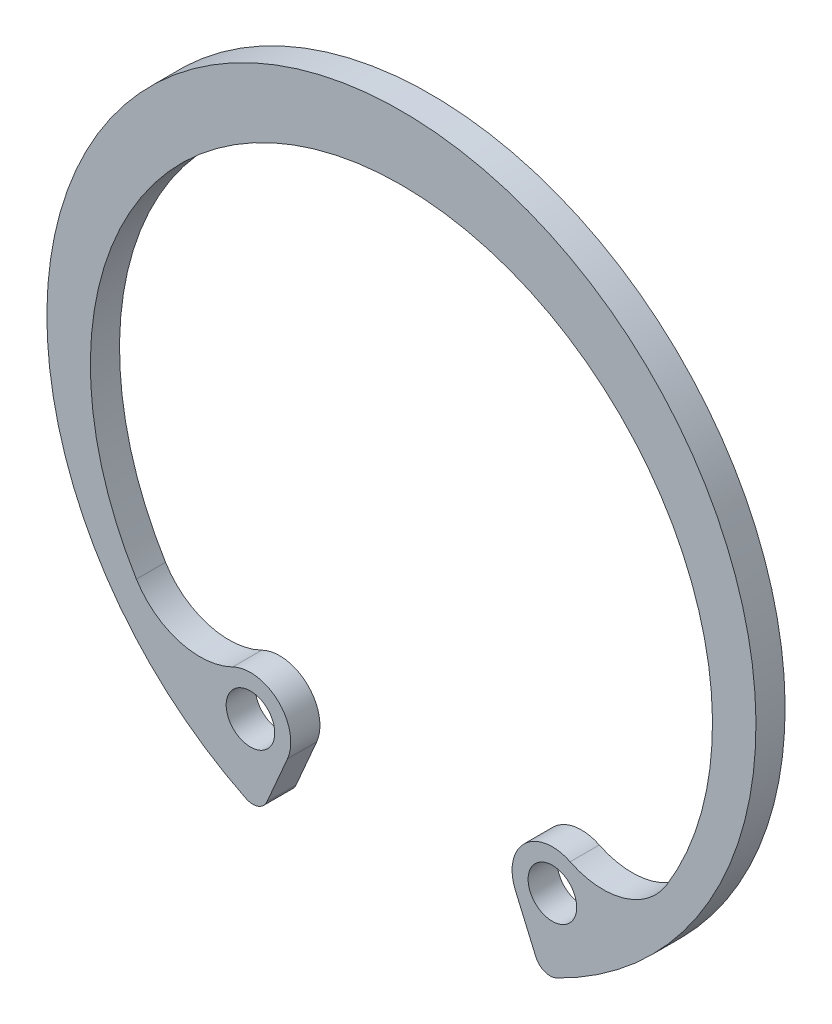
ISO-10303-21;
HEADER;
FILE_DESCRIPTION(('STEP AP214'),'2;1');
FILE_NAME('part.step','',(''),(''),'','','');
FILE_SCHEMA(('AUTOMOTIVE_DESIGN { 1 0 10303 214 1 1 1 1 }'));
ENDSEC;
DATA;
#1=APPLICATION_CONTEXT('core data for automotive mechanical design processes');
#2=APPLICATION_PROTOCOL_DEFINITION('international standard','automotive_design',2000,#1);
#3=PRODUCT_CONTEXT('',#1,'mechanical');
#4=PRODUCT('Part','Part','',(#3));
#5=PRODUCT_RELATED_PRODUCT_CATEGORY('part','',(#4));
#6=PRODUCT_DEFINITION_FORMATION('','',#4);
#7=PRODUCT_DEFINITION_CONTEXT('part definition',#1,'design');
#8=PRODUCT_DEFINITION('design','',#6,#7);
#9=PRODUCT_DEFINITION_SHAPE('','',#8);
#10=(LENGTH_UNIT() NAMED_UNIT(*) SI_UNIT(.MILLI.,.METRE.));
#11=(NAMED_UNIT(*) PLANE_ANGLE_UNIT() SI_UNIT($,.RADIAN.));
#12=(NAMED_UNIT(*) SI_UNIT($,.STERADIAN.) SOLID_ANGLE_UNIT());
#13=UNCERTAINTY_MEASURE_WITH_UNIT(LENGTH_MEASURE(1.E-05),#10,'distance_accuracy_value','');
#14=(GEOMETRIC_REPRESENTATION_CONTEXT(3) GLOBAL_UNCERTAINTY_ASSIGNED_CONTEXT((#13)) GLOBAL_UNIT_ASSIGNED_CONTEXT((#10,
#11,#12)) REPRESENTATION_CONTEXT('',''));
#15=CARTESIAN_POINT('',(0.,0.,0.));
#16=DIRECTION('',(0.,0.,1.));
#17=DIRECTION('',(1.,0.,0.));
#18=AXIS2_PLACEMENT_3D('',#15,#16,#17);
#19=CARTESIAN_POINT('',(0.,0.,-0.750000000000001));
#20=DIRECTION('',(0.,0.,1.));
#21=DIRECTION('',(1.,0.,0.));
#22=AXIS2_PLACEMENT_3D('',#19,#20,#21);
#23=CYLINDRICAL_SURFACE('',#22,18.25);
#24=CARTESIAN_POINT('',(0.,0.,0.749999999999999));
#25=DIRECTION('',(0.,0.,1.));
#26=DIRECTION('',(-1.,0.,0.));
#27=AXIS2_PLACEMENT_3D('',#24,#25,#26);
#28=CIRCLE('',#27,18.25);
#29=CARTESIAN_POINT('',(7.99738414547643,-16.4044002276731,0.749999999999999));
#30=VERTEX_POINT('',#29);
#31=CARTESIAN_POINT('',(-7.99738414547643,-16.4044002276731,0.749999999999999));
#32=VERTEX_POINT('',#31);
#33=EDGE_CURVE('E130',#30,#32,#28,.T.);
#34=ORIENTED_EDGE('',*,*,#33,.F.);
#35=DIRECTION('',(0.,0.,1.));
#36=VECTOR('',#35,1.);
#37=CARTESIAN_POINT('',(7.99738414547643,-16.4044002276731,-0.750000000000001));
#38=LINE('',#37,#36);
#39=CARTESIAN_POINT('',(7.99738414547643,-16.4044002276731,-0.750000000000001));
#40=VERTEX_POINT('',#39);
#41=EDGE_CURVE('E228',#30,#40,#38,.F.);
#42=ORIENTED_EDGE('',*,*,#41,.T.);
#43=CARTESIAN_POINT('',(0.,0.,-0.750000000000001));
#44=DIRECTION('',(0.,0.,1.));
#45=DIRECTION('',(-1.,0.,0.));
#46=AXIS2_PLACEMENT_3D('',#43,#44,#45);
#47=CIRCLE('',#46,18.25);
#48=CARTESIAN_POINT('',(-7.99738414547643,-16.4044002276731,-0.750000000000001));
#49=VERTEX_POINT('',#48);
#50=EDGE_CURVE('E174',#40,#49,#47,.T.);
#51=ORIENTED_EDGE('',*,*,#50,.T.);
#52=DIRECTION('',(0.,0.,1.));
#53=VECTOR('',#52,1.);
#54=CARTESIAN_POINT('',(-7.99738414547643,-16.4044002276731,-0.750000000000001));
#55=LINE('',#54,#53);
#56=EDGE_CURVE('E224',#49,#32,#55,.T.);
#57=ORIENTED_EDGE('',*,*,#56,.T.);
#58=EDGE_LOOP('',(#34,#42,#51,#57));
#59=FACE_BOUND('',#58,.T.);
#60=ADVANCED_FACE('F41',(#59),#23,.T.);
#61=CARTESIAN_POINT('',(5.86601370024973,-13.5661300033754,-0.750000000000001));
#62=DIRECTION('',(-0.917867410140358,-0.396887159533074,0.));
#63=DIRECTION('',(0.396887159533074,-0.917867410140358,0.));
#64=AXIS2_PLACEMENT_3D('',#61,#62,#63);
#65=PLANE('',#64);
#66=DIRECTION('',(0.396887159533074,-0.917867410140358,0.));
#67=VECTOR('',#66,1.);
#68=CARTESIAN_POINT('',(5.86601370024973,-13.5661300033754,-0.750000000000001));
#69=LINE('',#68,#67);
#70=CARTESIAN_POINT('',(5.86601370024973,-13.5661300033754,-0.750000000000001));
#71=VERTEX_POINT('',#70);
#72=CARTESIAN_POINT('',(6.92099545495303,-16.0059503595544,-0.750000000000001));
#73=VERTEX_POINT('',#72);
#74=EDGE_CURVE('E141',#71,#73,#69,.T.);
#75=ORIENTED_EDGE('',*,*,#74,.T.);
#76=DIRECTION('',(0.,0.,1.));
#77=VECTOR('',#76,1.);
#78=CARTESIAN_POINT('',(6.92099545495303,-16.0059503595544,-0.750000000000001));
#79=LINE('',#78,#77);
#80=CARTESIAN_POINT('',(6.92099545495303,-16.0059503595544,0.749999999999999));
#81=VERTEX_POINT('',#80);
#82=EDGE_CURVE('E204',#73,#81,#79,.T.);
#83=ORIENTED_EDGE('',*,*,#82,.T.);
#84=DIRECTION('',(0.396887159533074,-0.917867410140358,0.));
#85=VECTOR('',#84,1.);
#86=CARTESIAN_POINT('',(5.86601370024973,-13.5661300033754,0.749999999999999));
#87=LINE('',#86,#85);
#88=CARTESIAN_POINT('',(5.86601370024973,-13.5661300033754,0.749999999999999));
#89=VERTEX_POINT('',#88);
#90=EDGE_CURVE('E163',#89,#81,#87,.T.);
#91=ORIENTED_EDGE('',*,*,#90,.F.);
#92=DIRECTION('',(0.,0.,1.));
#93=VECTOR('',#92,1.);
#94=CARTESIAN_POINT('',(5.86601370024973,-13.5661300033754,-0.750000000000001));
#95=LINE('',#94,#93);
#96=EDGE_CURVE('E201',#71,#89,#95,.T.);
#97=ORIENTED_EDGE('',*,*,#96,.F.);
#98=EDGE_LOOP('',(#75,#83,#91,#97));
#99=FACE_BOUND('',#98,.T.);
#100=ADVANCED_FACE('F241',(#99),#65,.T.);
#101=CARTESIAN_POINT('',(7.77058857629097,-12.7425891473443,-0.750000000000001));
#102=DIRECTION('',(0.,0.,1.));
#103=DIRECTION('',(1.,0.,0.));
#104=AXIS2_PLACEMENT_3D('',#101,#102,#103);
#105=CYLINDRICAL_SURFACE('',#104,2.075);
#106=ORIENTED_EDGE('',*,*,#96,.T.);
#107=CARTESIAN_POINT('',(7.77058857629097,-12.7425891473443,0.749999999999999));
#108=DIRECTION('',(0.,0.,1.));
#109=DIRECTION('',(1.,0.,0.));
#110=AXIS2_PLACEMENT_3D('',#107,#108,#109);
#111=CIRCLE('',#110,2.075);
#112=CARTESIAN_POINT('',(8.68433991784718,-10.8796120981555,0.749999999999999));
#113=VERTEX_POINT('',#112);
#114=EDGE_CURVE('E159',#113,#89,#111,.T.);
#115=ORIENTED_EDGE('',*,*,#114,.F.);
#116=DIRECTION('',(0.,0.,1.));
#117=VECTOR('',#116,1.);
#118=CARTESIAN_POINT('',(8.68433991784718,-10.8796120981555,-0.750000000000001));
#119=LINE('',#118,#117);
#120=CARTESIAN_POINT('',(8.68433991784718,-10.8796120981555,-0.750000000000001));
#121=VERTEX_POINT('',#120);
#122=EDGE_CURVE('E205',#121,#113,#119,.T.);
#123=ORIENTED_EDGE('',*,*,#122,.F.);
#124=CARTESIAN_POINT('',(7.77058857629097,-12.7425891473443,-0.750000000000001));
#125=DIRECTION('',(0.,0.,1.));
#126=DIRECTION('',(1.,0.,0.));
#127=AXIS2_PLACEMENT_3D('',#124,#125,#126);
#128=CIRCLE('',#127,2.075);
#129=EDGE_CURVE('E194',#121,#71,#128,.T.);
#130=ORIENTED_EDGE('',*,*,#129,.T.);
#131=EDGE_LOOP('',(#106,#115,#123,#130));
#132=FACE_BOUND('',#131,.T.);
#133=ADVANCED_FACE('F274',(#132),#105,.T.);
#134=CARTESIAN_POINT('',(10.3740030126985,-7.43468849212455,-0.750000000000001));
#135=DIRECTION('',(0.,0.,1.));
#136=DIRECTION('',(1.,0.,0.));
#137=AXIS2_PLACEMENT_3D('',#134,#135,#136);
#138=CYLINDRICAL_SURFACE('',#137,3.83698579949049);
#139=ORIENTED_EDGE('',*,*,#122,.T.);
#140=CARTESIAN_POINT('',(10.3740030126985,-7.43468849212455,0.749999999999999));
#141=DIRECTION('',(0.,0.,-1.));
#142=DIRECTION('',(-1.,0.,0.));
#143=AXIS2_PLACEMENT_3D('',#140,#141,#142);
#144=CIRCLE('',#143,3.83698579949049);
#145=CARTESIAN_POINT('',(13.6433947729785,-9.4430553767612,0.749999999999999));
#146=VERTEX_POINT('',#145);
#147=EDGE_CURVE('E155',#146,#113,#144,.T.);
#148=ORIENTED_EDGE('',*,*,#147,.F.);
#149=DIRECTION('',(0.,0.,1.));
#150=VECTOR('',#149,1.);
#151=CARTESIAN_POINT('',(13.6433947729785,-9.4430553767612,-0.750000000000001));
#152=LINE('',#151,#150);
#153=CARTESIAN_POINT('',(13.6433947729785,-9.4430553767612,-0.750000000000001));
#154=VERTEX_POINT('',#153);
#155=EDGE_CURVE('E208',#154,#146,#152,.T.);
#156=ORIENTED_EDGE('',*,*,#155,.F.);
#157=CARTESIAN_POINT('',(10.3740030126985,-7.43468849212455,-0.750000000000001));
#158=DIRECTION('',(0.,0.,-1.));
#159=DIRECTION('',(-1.,0.,0.));
#160=AXIS2_PLACEMENT_3D('',#157,#158,#159);
#161=CIRCLE('',#160,3.83698579949049);
#162=EDGE_CURVE('E190',#154,#121,#161,.T.);
#163=ORIENTED_EDGE('',*,*,#162,.T.);
#164=EDGE_LOOP('',(#139,#148,#156,#163));
#165=FACE_BOUND('',#164,.T.);
#166=ADVANCED_FACE('F288',(#165),#138,.F.);
#167=CARTESIAN_POINT('',(0.,-1.06200340588074,-0.750000000000001));
#168=DIRECTION('',(0.,0.,1.));
#169=DIRECTION('',(1.,0.,0.));
#170=AXIS2_PLACEMENT_3D('',#167,#168,#169);
#171=CYLINDRICAL_SURFACE('',#170,16.0120034058807);
#172=ORIENTED_EDGE('',*,*,#155,.T.);
#173=CARTESIAN_POINT('',(0.,-1.06200340588074,0.749999999999999));
#174=DIRECTION('',(0.,0.,-1.));
#175=DIRECTION('',(-1.,0.,0.));
#176=AXIS2_PLACEMENT_3D('',#173,#174,#175);
#177=CIRCLE('',#176,16.0120034058807);
#178=CARTESIAN_POINT('',(-13.6433947729785,-9.4430553767612,0.749999999999999));
#179=VERTEX_POINT('',#178);
#180=EDGE_CURVE('E148',#179,#146,#177,.T.);
#181=ORIENTED_EDGE('',*,*,#180,.F.);
#182=DIRECTION('',(0.,0.,1.));
#183=VECTOR('',#182,1.);
#184=CARTESIAN_POINT('',(-13.6433947729785,-9.4430553767612,-0.750000000000001));
#185=LINE('',#184,#183);
#186=CARTESIAN_POINT('',(-13.6433947729785,-9.4430553767612,-0.750000000000001));
#187=VERTEX_POINT('',#186);
#188=EDGE_CURVE('E211',#187,#179,#185,.T.);
#189=ORIENTED_EDGE('',*,*,#188,.F.);
#190=CARTESIAN_POINT('',(0.,-1.06200340588074,-0.750000000000001));
#191=DIRECTION('',(0.,0.,-1.));
#192=DIRECTION('',(-1.,0.,0.));
#193=AXIS2_PLACEMENT_3D('',#190,#191,#192);
#194=CIRCLE('',#193,16.0120034058807);
#195=EDGE_CURVE('E186',#187,#154,#194,.T.);
#196=ORIENTED_EDGE('',*,*,#195,.T.);
#197=EDGE_LOOP('',(#172,#181,#189,#196));
#198=FACE_BOUND('',#197,.T.);
#199=ADVANCED_FACE('F284',(#198),#171,.F.);
#200=CARTESIAN_POINT('',(-10.3740030126985,-7.43468849212455,-0.750000000000001));
#201=DIRECTION('',(0.,0.,1.));
#202=DIRECTION('',(1.,0.,0.));
#203=AXIS2_PLACEMENT_3D('',#200,#201,#202);
#204=CYLINDRICAL_SURFACE('',#203,3.83698579949049);
#205=ORIENTED_EDGE('',*,*,#188,.T.);
#206=CARTESIAN_POINT('',(-10.3740030126985,-7.43468849212455,0.749999999999999));
#207=DIRECTION('',(0.,0.,-1.));
#208=DIRECTION('',(1.,0.,0.));
#209=AXIS2_PLACEMENT_3D('',#206,#207,#208);
#210=CIRCLE('',#209,3.83698579949049);
#211=CARTESIAN_POINT('',(-8.68433991784718,-10.8796120981555,0.749999999999999));
#212=VERTEX_POINT('',#211);
#213=EDGE_CURVE('E145',#212,#179,#210,.T.);
#214=ORIENTED_EDGE('',*,*,#213,.F.);
#215=DIRECTION('',(0.,0.,1.));
#216=VECTOR('',#215,1.);
#217=CARTESIAN_POINT('',(-8.68433991784718,-10.8796120981555,-0.750000000000001));
#218=LINE('',#217,#216);
#219=CARTESIAN_POINT('',(-8.68433991784718,-10.8796120981555,-0.750000000000001));
#220=VERTEX_POINT('',#219);
#221=EDGE_CURVE('E140',#220,#212,#218,.T.);
#222=ORIENTED_EDGE('',*,*,#221,.F.);
#223=CARTESIAN_POINT('',(-10.3740030126985,-7.43468849212455,-0.750000000000001));
#224=DIRECTION('',(0.,0.,-1.));
#225=DIRECTION('',(1.,0.,0.));
#226=AXIS2_PLACEMENT_3D('',#223,#224,#225);
#227=CIRCLE('',#226,3.83698579949049);
#228=EDGE_CURVE('E182',#220,#187,#227,.T.);
#229=ORIENTED_EDGE('',*,*,#228,.T.);
#230=EDGE_LOOP('',(#205,#214,#222,#229));
#231=FACE_BOUND('',#230,.T.);
#232=ADVANCED_FACE('F281',(#231),#204,.F.);
#233=CARTESIAN_POINT('',(-7.77058857629097,-12.7425891473443,-0.750000000000001));
#234=DIRECTION('',(0.,0.,1.));
#235=DIRECTION('',(1.,0.,0.));
#236=AXIS2_PLACEMENT_3D('',#233,#234,#235);
#237=CYLINDRICAL_SURFACE('',#236,2.075);
#238=ORIENTED_EDGE('',*,*,#221,.T.);
#239=CARTESIAN_POINT('',(-7.77058857629097,-12.7425891473443,0.749999999999999));
#240=DIRECTION('',(0.,0.,1.));
#241=DIRECTION('',(-1.,0.,0.));
#242=AXIS2_PLACEMENT_3D('',#239,#240,#241);
#243=CIRCLE('',#242,2.075);
#244=CARTESIAN_POINT('',(-5.86601370024973,-13.5661300033754,0.749999999999999));
#245=VERTEX_POINT('',#244);
#246=EDGE_CURVE('E125',#245,#212,#243,.T.);
#247=ORIENTED_EDGE('',*,*,#246,.F.);
#248=DIRECTION('',(0.,0.,1.));
#249=VECTOR('',#248,1.);
#250=CARTESIAN_POINT('',(-5.86601370024973,-13.5661300033754,-0.750000000000001));
#251=LINE('',#250,#249);
#252=CARTESIAN_POINT('',(-5.86601370024973,-13.5661300033754,-0.750000000000001));
#253=VERTEX_POINT('',#252);
#254=EDGE_CURVE('E133',#253,#245,#251,.T.);
#255=ORIENTED_EDGE('',*,*,#254,.F.);
#256=CARTESIAN_POINT('',(-7.77058857629097,-12.7425891473443,-0.750000000000001));
#257=DIRECTION('',(0.,0.,1.));
#258=DIRECTION('',(-1.,0.,0.));
#259=AXIS2_PLACEMENT_3D('',#256,#257,#258);
#260=CIRCLE('',#259,2.075);
#261=EDGE_CURVE('E179',#253,#220,#260,.T.);
#262=ORIENTED_EDGE('',*,*,#261,.T.);
#263=EDGE_LOOP('',(#238,#247,#255,#262));
#264=FACE_BOUND('',#263,.T.);
#265=ADVANCED_FACE('F143',(#264),#237,.T.);
#266=CARTESIAN_POINT('',(-5.86601370024973,-13.5661300033754,-0.750000000000001));
#267=DIRECTION('',(0.917867410140358,-0.396887159533074,0.));
#268=DIRECTION('',(0.396887159533074,0.917867410140358,0.));
#269=AXIS2_PLACEMENT_3D('',#266,#267,#268);
#270=PLANE('',#269);
#271=DIRECTION('',(0.396887159533074,0.917867410140358,0.));
#272=VECTOR('',#271,1.);
#273=CARTESIAN_POINT('',(-5.86601370024973,-13.5661300033754,0.749999999999999));
#274=LINE('',#273,#272);
#275=CARTESIAN_POINT('',(-6.92099545495303,-16.0059503595544,0.749999999999999));
#276=VERTEX_POINT('',#275);
#277=EDGE_CURVE('E118',#276,#245,#274,.T.);
#278=ORIENTED_EDGE('',*,*,#277,.F.);
#279=DIRECTION('',(0.,0.,1.));
#280=VECTOR('',#279,1.);
#281=CARTESIAN_POINT('',(-6.92099545495303,-16.0059503595544,-0.750000000000001));
#282=LINE('',#281,#280);
#283=CARTESIAN_POINT('',(-6.92099545495303,-16.0059503595544,-0.750000000000001));
#284=VERTEX_POINT('',#283);
#285=EDGE_CURVE('E11',#276,#284,#282,.F.);
#286=ORIENTED_EDGE('',*,*,#285,.T.);
#287=DIRECTION('',(0.396887159533074,0.917867410140358,0.));
#288=VECTOR('',#287,1.);
#289=CARTESIAN_POINT('',(-5.86601370024973,-13.5661300033754,-0.750000000000001));
#290=LINE('',#289,#288);
#291=EDGE_CURVE('E135',#284,#253,#290,.T.);
#292=ORIENTED_EDGE('',*,*,#291,.T.);
#293=ORIENTED_EDGE('',*,*,#254,.T.);
#294=EDGE_LOOP('',(#278,#286,#292,#293));
#295=FACE_BOUND('',#294,.T.);
#296=ADVANCED_FACE('F134',(#295),#270,.T.);
#297=CARTESIAN_POINT('',(0.,0.,-0.750000000000001));
#298=DIRECTION('',(0.,0.,-1.));
#299=DIRECTION('',(-1.,0.,0.));
#300=AXIS2_PLACEMENT_3D('',#297,#298,#299);
#301=PLANE('',#300);
#302=CARTESIAN_POINT('',(7.77058857629097,-12.7425891473443,-0.750000000000001));
#303=DIRECTION('',(0.,0.,1.));
#304=DIRECTION('',(-1.,0.,0.));
#305=AXIS2_PLACEMENT_3D('',#302,#303,#304);
#306=CIRCLE('',#305,1.25);
#307=CARTESIAN_POINT('',(6.52058857629097,-12.7425891473443,-0.750000000000001));
#308=VERTEX_POINT('',#307);
#309=EDGE_CURVE('E166',#308,#308,#306,.T.);
#310=ORIENTED_EDGE('',*,*,#309,.T.);
#311=EDGE_LOOP('',(#310));
#312=FACE_BOUND('',#311,.T.);
#313=CARTESIAN_POINT('',(-7.77058857629097,-12.7425891473443,-0.750000000000001));
#314=DIRECTION('',(0.,0.,1.));
#315=DIRECTION('',(1.,0.,0.));
#316=AXIS2_PLACEMENT_3D('',#313,#314,#315);
#317=CIRCLE('',#316,1.25);
#318=CARTESIAN_POINT('',(-6.52058857629097,-12.7425891473443,-0.750000000000001));
#319=VERTEX_POINT('',#318);
#320=EDGE_CURVE('E170',#319,#319,#317,.T.);
#321=ORIENTED_EDGE('',*,*,#320,.T.);
#322=EDGE_LOOP('',(#321));
#323=FACE_BOUND('',#322,.T.);
#324=ORIENTED_EDGE('',*,*,#50,.F.);
#325=CARTESIAN_POINT('',(7.64955271175194,-15.690921176675,-0.750000000000001));
#326=DIRECTION('',(0.,0.,-1.));
#327=DIRECTION('',(-1.,0.,0.));
#328=AXIS2_PLACEMENT_3D('',#325,#326,#327);
#329=CIRCLE('',#328,0.79375);
#330=EDGE_CURVE('E50',#40,#73,#329,.T.);
#331=ORIENTED_EDGE('',*,*,#330,.T.);
#332=ORIENTED_EDGE('',*,*,#74,.F.);
#333=ORIENTED_EDGE('',*,*,#129,.F.);
#334=ORIENTED_EDGE('',*,*,#162,.F.);
#335=ORIENTED_EDGE('',*,*,#195,.F.);
#336=ORIENTED_EDGE('',*,*,#228,.F.);
#337=ORIENTED_EDGE('',*,*,#261,.F.);
#338=ORIENTED_EDGE('',*,*,#291,.F.);
#339=CARTESIAN_POINT('',(-7.64955271175194,-15.690921176675,-0.750000000000001));
#340=DIRECTION('',(0.,0.,-1.));
#341=DIRECTION('',(-1.,0.,0.));
#342=AXIS2_PLACEMENT_3D('',#339,#340,#341);
#343=CIRCLE('',#342,0.79375);
#344=EDGE_CURVE('E62',#284,#49,#343,.T.);
#345=ORIENTED_EDGE('',*,*,#344,.T.);
#346=EDGE_LOOP('',(#324,#331,#332,#333,#334,#335,#336,#337,#338,#345));
#347=FACE_BOUND('',#346,.T.);
#348=ADVANCED_FACE('F235',(#312,#323,#347),#301,.T.);
#349=CARTESIAN_POINT('',(-7.77058857629097,-12.7425891473443,-0.750000000000001));
#350=DIRECTION('',(0.,0.,1.));
#351=DIRECTION('',(1.,0.,0.));
#352=AXIS2_PLACEMENT_3D('',#349,#350,#351);
#353=CYLINDRICAL_SURFACE('',#352,1.25);
#354=ORIENTED_EDGE('',*,*,#320,.F.);
#355=EDGE_LOOP('',(#354));
#356=FACE_BOUND('',#355,.T.);
#357=CARTESIAN_POINT('',(-7.77058857629097,-12.7425891473443,0.749999999999999));
#358=DIRECTION('',(0.,0.,1.));
#359=DIRECTION('',(1.,0.,0.));
#360=AXIS2_PLACEMENT_3D('',#357,#358,#359);
#361=CIRCLE('',#360,1.25);
#362=CARTESIAN_POINT('',(-6.52058857629097,-12.7425891473443,0.749999999999999));
#363=VERTEX_POINT('',#362);
#364=EDGE_CURVE('E248',#363,#363,#361,.T.);
#365=ORIENTED_EDGE('',*,*,#364,.T.);
#366=EDGE_LOOP('',(#365));
#367=FACE_BOUND('',#366,.T.);
#368=ADVANCED_FACE('F266',(#356,#367),#353,.F.);
#369=CARTESIAN_POINT('',(7.77058857629097,-12.7425891473443,-0.750000000000001));
#370=DIRECTION('',(0.,0.,1.));
#371=DIRECTION('',(1.,0.,0.));
#372=AXIS2_PLACEMENT_3D('',#369,#370,#371);
#373=CYLINDRICAL_SURFACE('',#372,1.25);
#374=ORIENTED_EDGE('',*,*,#309,.F.);
#375=EDGE_LOOP('',(#374));
#376=FACE_BOUND('',#375,.T.);
#377=CARTESIAN_POINT('',(7.77058857629097,-12.7425891473443,0.749999999999999));
#378=DIRECTION('',(0.,0.,1.));
#379=DIRECTION('',(-1.,0.,0.));
#380=AXIS2_PLACEMENT_3D('',#377,#378,#379);
#381=CIRCLE('',#380,1.25);
#382=CARTESIAN_POINT('',(6.52058857629097,-12.7425891473443,0.749999999999999));
#383=VERTEX_POINT('',#382);
#384=EDGE_CURVE('E251',#383,#383,#381,.T.);
#385=ORIENTED_EDGE('',*,*,#384,.T.);
#386=EDGE_LOOP('',(#385));
#387=FACE_BOUND('',#386,.T.);
#388=ADVANCED_FACE('F258',(#376,#387),#373,.F.);
#389=CARTESIAN_POINT('',(0.,0.,0.749999999999999));
#390=DIRECTION('',(0.,0.,-1.));
#391=DIRECTION('',(-1.,0.,0.));
#392=AXIS2_PLACEMENT_3D('',#389,#390,#391);
#393=PLANE('',#392);
#394=ORIENTED_EDGE('',*,*,#90,.T.);
#395=CARTESIAN_POINT('',(7.64955271175194,-15.690921176675,0.749999999999999));
#396=DIRECTION('',(0.,0.,-1.));
#397=DIRECTION('',(-1.,0.,0.));
#398=AXIS2_PLACEMENT_3D('',#395,#396,#397);
#399=CIRCLE('',#398,0.79375);
#400=EDGE_CURVE('E221',#81,#30,#399,.F.);
#401=ORIENTED_EDGE('',*,*,#400,.T.);
#402=ORIENTED_EDGE('',*,*,#33,.T.);
#403=CARTESIAN_POINT('',(-7.64955271175194,-15.690921176675,0.749999999999999));
#404=DIRECTION('',(0.,0.,-1.));
#405=DIRECTION('',(-1.,0.,0.));
#406=AXIS2_PLACEMENT_3D('',#403,#404,#405);
#407=CIRCLE('',#406,0.79375);
#408=EDGE_CURVE('E128',#32,#276,#407,.F.);
#409=ORIENTED_EDGE('',*,*,#408,.T.);
#410=ORIENTED_EDGE('',*,*,#277,.T.);
#411=ORIENTED_EDGE('',*,*,#246,.T.);
#412=ORIENTED_EDGE('',*,*,#213,.T.);
#413=ORIENTED_EDGE('',*,*,#180,.T.);
#414=ORIENTED_EDGE('',*,*,#147,.T.);
#415=ORIENTED_EDGE('',*,*,#114,.T.);
#416=EDGE_LOOP('',(#394,#401,#402,#409,#410,#411,#412,#413,#414,#415));
#417=FACE_BOUND('',#416,.T.);
#418=ORIENTED_EDGE('',*,*,#364,.F.);
#419=EDGE_LOOP('',(#418));
#420=FACE_BOUND('',#419,.T.);
#421=ORIENTED_EDGE('',*,*,#384,.F.);
#422=EDGE_LOOP('',(#421));
#423=FACE_BOUND('',#422,.T.);
#424=ADVANCED_FACE('F121',(#417,#420,#423),#393,.F.);
#425=CARTESIAN_POINT('',(7.64955271175194,-15.690921176675,-0.750000000000001));
#426=DIRECTION('',(0.,0.,1.));
#427=DIRECTION('',(1.,0.,0.));
#428=AXIS2_PLACEMENT_3D('',#425,#426,#427);
#429=CYLINDRICAL_SURFACE('',#428,0.79375);
#430=ORIENTED_EDGE('',*,*,#330,.F.);
#431=ORIENTED_EDGE('',*,*,#41,.F.);
#432=ORIENTED_EDGE('',*,*,#400,.F.);
#433=ORIENTED_EDGE('',*,*,#82,.F.);
#434=EDGE_LOOP('',(#430,#431,#432,#433));
#435=FACE_BOUND('',#434,.T.);
#436=ADVANCED_FACE('F243',(#435),#429,.T.);
#437=CARTESIAN_POINT('',(-7.64955271175194,-15.690921176675,-0.750000000000001));
#438=DIRECTION('',(0.,0.,1.));
#439=DIRECTION('',(1.,0.,0.));
#440=AXIS2_PLACEMENT_3D('',#437,#438,#439);
#441=CYLINDRICAL_SURFACE('',#440,0.79375);
#442=ORIENTED_EDGE('',*,*,#344,.F.);
#443=ORIENTED_EDGE('',*,*,#285,.F.);
#444=ORIENTED_EDGE('',*,*,#408,.F.);
#445=ORIENTED_EDGE('',*,*,#56,.F.);
#446=EDGE_LOOP('',(#442,#443,#444,#445));
#447=FACE_BOUND('',#446,.T.);
#448=ADVANCED_FACE('F43',(#447),#441,.T.);
#449=CLOSED_SHELL('',(#60,#100,#133,#166,#199,#232,#265,#296,#348,#368,#388,#424,#436,#448));
#450=MANIFOLD_SOLID_BREP('B2',#449);
#451=ADVANCED_BREP_SHAPE_REPRESENTATION('',(#18,#450),#14);
#452=SHAPE_DEFINITION_REPRESENTATION(#9,#451);
ENDSEC;
END-ISO-10303-21;
